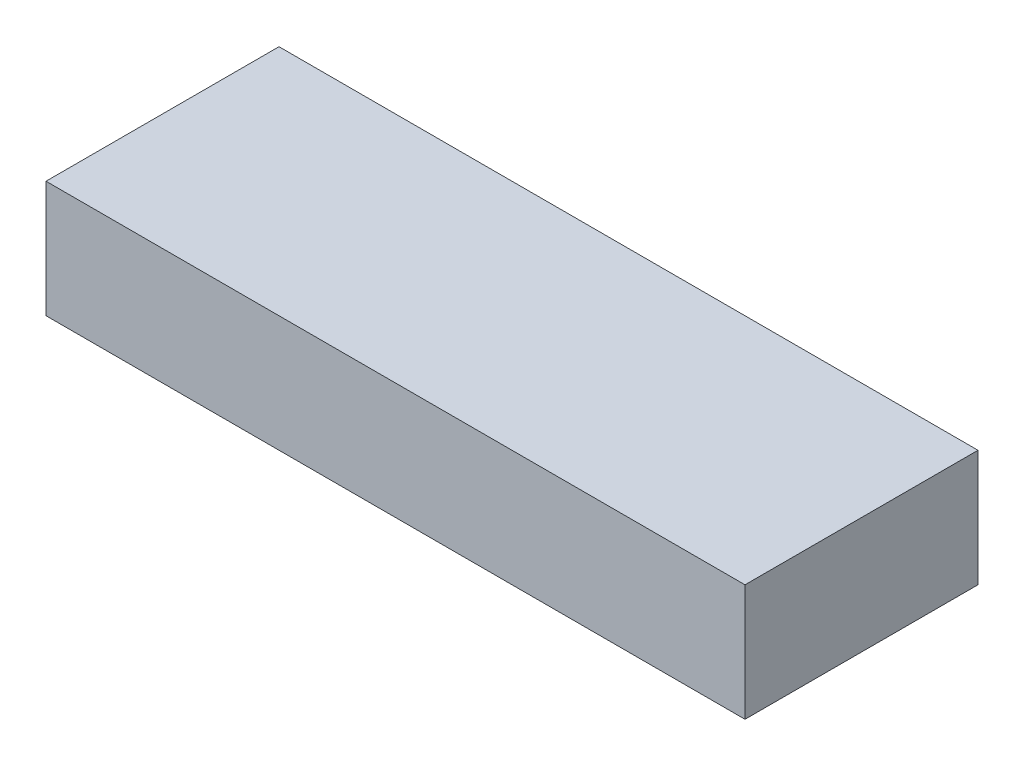
ISO-10303-21;
HEADER;
FILE_DESCRIPTION(('STEP AP214'),'2;1');
FILE_NAME('part.step','',(''),(''),'','','');
FILE_SCHEMA(('AUTOMOTIVE_DESIGN { 1 0 10303 214 1 1 1 1 }'));
ENDSEC;
DATA;
#1=APPLICATION_CONTEXT('core data for automotive mechanical design processes');
#2=APPLICATION_PROTOCOL_DEFINITION('international standard','automotive_design',2000,#1);
#3=PRODUCT_CONTEXT('',#1,'mechanical');
#4=PRODUCT('Part','Part','',(#3));
#5=PRODUCT_RELATED_PRODUCT_CATEGORY('part','',(#4));
#6=PRODUCT_DEFINITION_FORMATION('','',#4);
#7=PRODUCT_DEFINITION_CONTEXT('part definition',#1,'design');
#8=PRODUCT_DEFINITION('design','',#6,#7);
#9=PRODUCT_DEFINITION_SHAPE('','',#8);
#10=(LENGTH_UNIT() NAMED_UNIT(*) SI_UNIT(.MILLI.,.METRE.));
#11=(NAMED_UNIT(*) PLANE_ANGLE_UNIT() SI_UNIT($,.RADIAN.));
#12=(NAMED_UNIT(*) SI_UNIT($,.STERADIAN.) SOLID_ANGLE_UNIT());
#13=UNCERTAINTY_MEASURE_WITH_UNIT(LENGTH_MEASURE(1.E-05),#10,'distance_accuracy_value','');
#14=(GEOMETRIC_REPRESENTATION_CONTEXT(3) GLOBAL_UNCERTAINTY_ASSIGNED_CONTEXT((#13)) GLOBAL_UNIT_ASSIGNED_CONTEXT((#10,
#11,#12)) REPRESENTATION_CONTEXT('',''));
#15=CARTESIAN_POINT('',(0.,0.,0.));
#16=DIRECTION('',(0.,0.,1.));
#17=DIRECTION('',(1.,0.,0.));
#18=AXIS2_PLACEMENT_3D('',#15,#16,#17);
#19=CARTESIAN_POINT('',(15.,2.5,-5.00000000000002));
#20=DIRECTION('',(-1.,0.,0.));
#21=DIRECTION('',(0.,0.,1.));
#22=AXIS2_PLACEMENT_3D('',#19,#20,#21);
#23=PLANE('',#22);
#24=DIRECTION('',(0.,0.,-1.));
#25=VECTOR('',#24,1.);
#26=CARTESIAN_POINT('',(15.,-2.5,-5.00000000000002));
#27=LINE('',#26,#25);
#28=CARTESIAN_POINT('',(15.,-2.5,4.99999999999998));
#29=VERTEX_POINT('',#28);
#30=CARTESIAN_POINT('',(15.,-2.5,-5.00000000000002));
#31=VERTEX_POINT('',#30);
#32=EDGE_CURVE('E107',#29,#31,#27,.T.);
#33=ORIENTED_EDGE('',*,*,#32,.T.);
#34=DIRECTION('',(0.,-1.,0.));
#35=VECTOR('',#34,1.);
#36=CARTESIAN_POINT('',(15.,2.5,-5.00000000000002));
#37=LINE('',#36,#35);
#38=CARTESIAN_POINT('',(15.,2.5,-5.00000000000002));
#39=VERTEX_POINT('',#38);
#40=EDGE_CURVE('E11',#39,#31,#37,.T.);
#41=ORIENTED_EDGE('',*,*,#40,.F.);
#42=DIRECTION('',(0.,0.,-1.));
#43=VECTOR('',#42,1.);
#44=CARTESIAN_POINT('',(15.,2.5,-5.00000000000002));
#45=LINE('',#44,#43);
#46=CARTESIAN_POINT('',(15.,2.5,4.99999999999998));
#47=VERTEX_POINT('',#46);
#48=EDGE_CURVE('E91',#47,#39,#45,.T.);
#49=ORIENTED_EDGE('',*,*,#48,.F.);
#50=DIRECTION('',(0.,-1.,0.));
#51=VECTOR('',#50,1.);
#52=CARTESIAN_POINT('',(15.,2.5,4.99999999999998));
#53=LINE('',#52,#51);
#54=EDGE_CURVE('E103',#47,#29,#53,.T.);
#55=ORIENTED_EDGE('',*,*,#54,.T.);
#56=EDGE_LOOP('',(#33,#41,#49,#55));
#57=FACE_BOUND('',#56,.T.);
#58=ADVANCED_FACE('F39',(#57),#23,.F.);
#59=CARTESIAN_POINT('',(15.,2.5,-5.00000000000002));
#60=DIRECTION('',(0.,0.,1.));
#61=DIRECTION('',(1.,0.,0.));
#62=AXIS2_PLACEMENT_3D('',#59,#60,#61);
#63=PLANE('',#62);
#64=DIRECTION('',(-1.,0.,0.));
#65=VECTOR('',#64,1.);
#66=CARTESIAN_POINT('',(15.,-2.5,-5.00000000000002));
#67=LINE('',#66,#65);
#68=CARTESIAN_POINT('',(-15.,-2.5,-5.00000000000001));
#69=VERTEX_POINT('',#68);
#70=EDGE_CURVE('E96',#31,#69,#67,.T.);
#71=ORIENTED_EDGE('',*,*,#70,.T.);
#72=DIRECTION('',(0.,-1.,0.));
#73=VECTOR('',#72,1.);
#74=CARTESIAN_POINT('',(-15.,2.5,-5.00000000000001));
#75=LINE('',#74,#73);
#76=CARTESIAN_POINT('',(-15.,2.5,-5.00000000000001));
#77=VERTEX_POINT('',#76);
#78=EDGE_CURVE('E48',#77,#69,#75,.T.);
#79=ORIENTED_EDGE('',*,*,#78,.F.);
#80=DIRECTION('',(-1.,0.,0.));
#81=VECTOR('',#80,1.);
#82=CARTESIAN_POINT('',(15.,2.5,-5.00000000000002));
#83=LINE('',#82,#81);
#84=EDGE_CURVE('E86',#39,#77,#83,.T.);
#85=ORIENTED_EDGE('',*,*,#84,.F.);
#86=ORIENTED_EDGE('',*,*,#40,.T.);
#87=EDGE_LOOP('',(#71,#79,#85,#86));
#88=FACE_BOUND('',#87,.T.);
#89=ADVANCED_FACE('F95',(#88),#63,.F.);
#90=CARTESIAN_POINT('',(-15.,2.5,-5.00000000000001));
#91=DIRECTION('',(1.,0.,0.));
#92=DIRECTION('',(0.,0.,-1.));
#93=AXIS2_PLACEMENT_3D('',#90,#91,#92);
#94=PLANE('',#93);
#95=DIRECTION('',(0.,0.,1.));
#96=VECTOR('',#95,1.);
#97=CARTESIAN_POINT('',(-15.,-2.5,-5.00000000000001));
#98=LINE('',#97,#96);
#99=CARTESIAN_POINT('',(-15.,-2.5,4.99999999999998));
#100=VERTEX_POINT('',#99);
#101=EDGE_CURVE('E73',#69,#100,#98,.T.);
#102=ORIENTED_EDGE('',*,*,#101,.T.);
#103=DIRECTION('',(0.,-1.,0.));
#104=VECTOR('',#103,1.);
#105=CARTESIAN_POINT('',(-15.,2.5,4.99999999999998));
#106=LINE('',#105,#104);
#107=CARTESIAN_POINT('',(-15.,2.5,4.99999999999998));
#108=VERTEX_POINT('',#107);
#109=EDGE_CURVE('E98',#108,#100,#106,.T.);
#110=ORIENTED_EDGE('',*,*,#109,.F.);
#111=DIRECTION('',(0.,0.,1.));
#112=VECTOR('',#111,1.);
#113=CARTESIAN_POINT('',(-15.,2.5,-5.00000000000001));
#114=LINE('',#113,#112);
#115=EDGE_CURVE('E89',#77,#108,#114,.T.);
#116=ORIENTED_EDGE('',*,*,#115,.F.);
#117=ORIENTED_EDGE('',*,*,#78,.T.);
#118=EDGE_LOOP('',(#102,#110,#116,#117));
#119=FACE_BOUND('',#118,.T.);
#120=ADVANCED_FACE('F99',(#119),#94,.F.);
#121=CARTESIAN_POINT('',(15.,2.5,4.99999999999998));
#122=DIRECTION('',(0.,0.,-1.));
#123=DIRECTION('',(-1.,0.,0.));
#124=AXIS2_PLACEMENT_3D('',#121,#122,#123);
#125=PLANE('',#124);
#126=DIRECTION('',(1.,0.,0.));
#127=VECTOR('',#126,1.);
#128=CARTESIAN_POINT('',(15.,-2.5,4.99999999999998));
#129=LINE('',#128,#127);
#130=EDGE_CURVE('E79',#100,#29,#129,.T.);
#131=ORIENTED_EDGE('',*,*,#130,.T.);
#132=ORIENTED_EDGE('',*,*,#54,.F.);
#133=DIRECTION('',(1.,0.,0.));
#134=VECTOR('',#133,1.);
#135=CARTESIAN_POINT('',(15.,2.5,4.99999999999998));
#136=LINE('',#135,#134);
#137=EDGE_CURVE('E56',#108,#47,#136,.T.);
#138=ORIENTED_EDGE('',*,*,#137,.F.);
#139=ORIENTED_EDGE('',*,*,#109,.T.);
#140=EDGE_LOOP('',(#131,#132,#138,#139));
#141=FACE_BOUND('',#140,.T.);
#142=ADVANCED_FACE('F120',(#141),#125,.F.);
#143=CARTESIAN_POINT('',(0.,2.5,0.));
#144=DIRECTION('',(0.,-1.,0.));
#145=DIRECTION('',(0.,0.,-1.));
#146=AXIS2_PLACEMENT_3D('',#143,#144,#145);
#147=PLANE('',#146);
#148=ORIENTED_EDGE('',*,*,#48,.T.);
#149=ORIENTED_EDGE('',*,*,#84,.T.);
#150=ORIENTED_EDGE('',*,*,#115,.T.);
#151=ORIENTED_EDGE('',*,*,#137,.T.);
#152=EDGE_LOOP('',(#148,#149,#150,#151));
#153=FACE_BOUND('',#152,.T.);
#154=ADVANCED_FACE('F87',(#153),#147,.F.);
#155=CARTESIAN_POINT('',(0.,-2.5,0.));
#156=DIRECTION('',(0.,-1.,0.));
#157=DIRECTION('',(0.,0.,-1.));
#158=AXIS2_PLACEMENT_3D('',#155,#156,#157);
#159=PLANE('',#158);
#160=ORIENTED_EDGE('',*,*,#32,.F.);
#161=ORIENTED_EDGE('',*,*,#130,.F.);
#162=ORIENTED_EDGE('',*,*,#101,.F.);
#163=ORIENTED_EDGE('',*,*,#70,.F.);
#164=EDGE_LOOP('',(#160,#161,#162,#163));
#165=FACE_BOUND('',#164,.T.);
#166=ADVANCED_FACE('F123',(#165),#159,.T.);
#167=CLOSED_SHELL('',(#58,#89,#120,#142,#154,#166));
#168=MANIFOLD_SOLID_BREP('B2',#167);
#169=ADVANCED_BREP_SHAPE_REPRESENTATION('',(#18,#168),#14);
#170=SHAPE_DEFINITION_REPRESENTATION(#9,#169);
ENDSEC;
END-ISO-10303-21;
